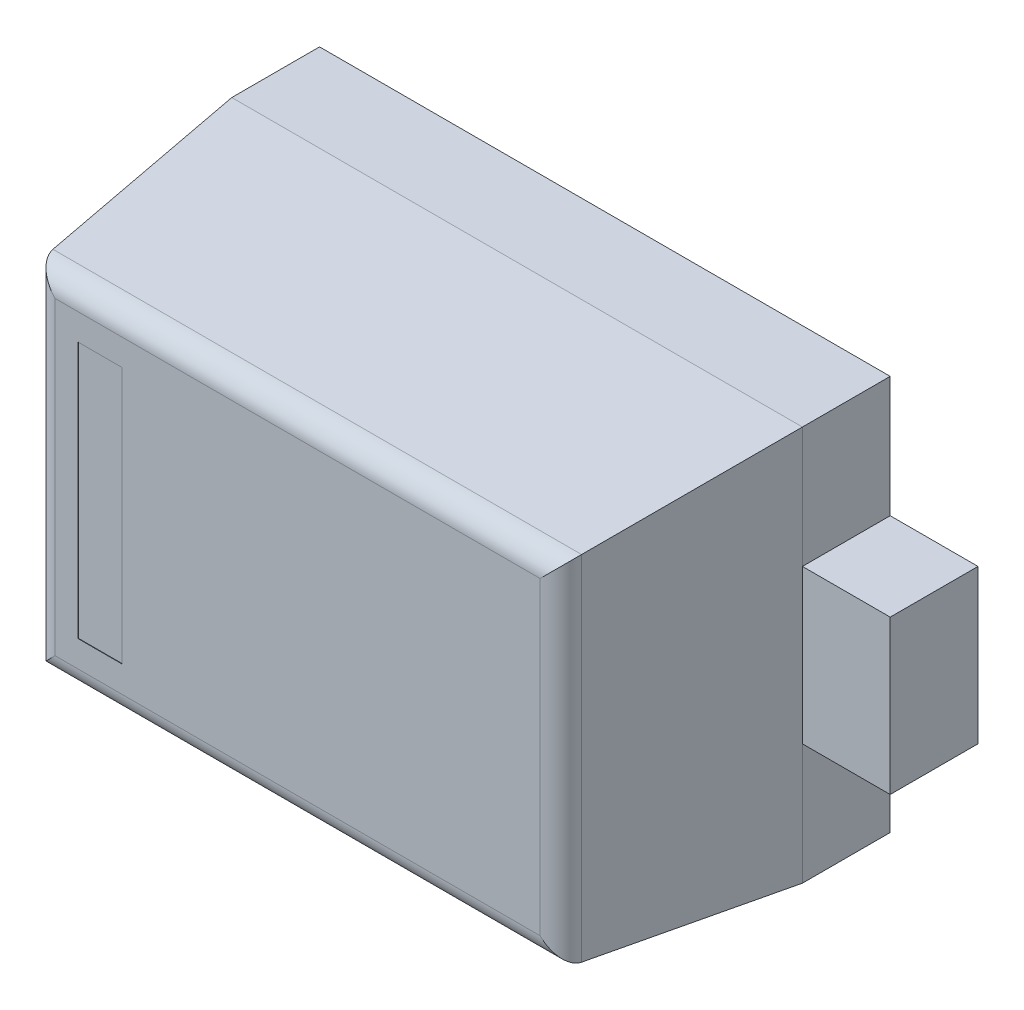
ISO-10303-21;
HEADER;
FILE_DESCRIPTION(('STEP AP214'),'2;1');
FILE_NAME('part.step','',(''),(''),'','','');
FILE_SCHEMA(('AUTOMOTIVE_DESIGN { 1 0 10303 214 1 1 1 1 }'));
ENDSEC;
DATA;
#1=APPLICATION_CONTEXT('core data for automotive mechanical design processes');
#2=APPLICATION_PROTOCOL_DEFINITION('international standard','automotive_design',2000,#1);
#3=PRODUCT_CONTEXT('',#1,'mechanical');
#4=PRODUCT('Part','Part','',(#3));
#5=PRODUCT_RELATED_PRODUCT_CATEGORY('part','',(#4));
#6=PRODUCT_DEFINITION_FORMATION('','',#4);
#7=PRODUCT_DEFINITION_CONTEXT('part definition',#1,'design');
#8=PRODUCT_DEFINITION('design','',#6,#7);
#9=PRODUCT_DEFINITION_SHAPE('','',#8);
#10=(LENGTH_UNIT() NAMED_UNIT(*) SI_UNIT(.MILLI.,.METRE.));
#11=(NAMED_UNIT(*) PLANE_ANGLE_UNIT() SI_UNIT($,.RADIAN.));
#12=(NAMED_UNIT(*) SI_UNIT($,.STERADIAN.) SOLID_ANGLE_UNIT());
#13=UNCERTAINTY_MEASURE_WITH_UNIT(LENGTH_MEASURE(1.E-05),#10,'distance_accuracy_value','');
#14=(GEOMETRIC_REPRESENTATION_CONTEXT(3) GLOBAL_UNCERTAINTY_ASSIGNED_CONTEXT((#13)) GLOBAL_UNIT_ASSIGNED_CONTEXT((#10,
#11,#12)) REPRESENTATION_CONTEXT('',''));
#15=CARTESIAN_POINT('',(0.,0.,0.));
#16=DIRECTION('',(0.,0.,1.));
#17=DIRECTION('',(1.,0.,0.));
#18=AXIS2_PLACEMENT_3D('',#15,#16,#17);
#19=CARTESIAN_POINT('',(0.,0.,0.2));
#20=DIRECTION('',(0.,0.,-1.));
#21=DIRECTION('',(0.,-1.,0.));
#22=AXIS2_PLACEMENT_3D('',#19,#20,#21);
#23=PLANE('',#22);
#24=DIRECTION('',(0.,-1.,0.));
#25=VECTOR('',#24,1.);
#26=CARTESIAN_POINT('',(-0.85,0.175,0.2));
#27=LINE('',#26,#25);
#28=CARTESIAN_POINT('',(-0.85,0.175,0.2));
#29=VERTEX_POINT('',#28);
#30=CARTESIAN_POINT('',(-0.85,-0.175,0.2));
#31=VERTEX_POINT('',#30);
#32=EDGE_CURVE('E262',#29,#31,#27,.T.);
#33=ORIENTED_EDGE('',*,*,#32,.T.);
#34=DIRECTION('',(1.,0.,0.));
#35=VECTOR('',#34,1.);
#36=CARTESIAN_POINT('',(-0.65,-0.175,0.2));
#37=LINE('',#36,#35);
#38=CARTESIAN_POINT('',(-0.65,-0.175,0.2));
#39=VERTEX_POINT('',#38);
#40=EDGE_CURVE('E30',#31,#39,#37,.T.);
#41=ORIENTED_EDGE('',*,*,#40,.T.);
#42=DIRECTION('',(0.,1.,0.));
#43=VECTOR('',#42,1.);
#44=CARTESIAN_POINT('',(-0.65,0.175,0.2));
#45=LINE('',#44,#43);
#46=CARTESIAN_POINT('',(-0.65,0.175,0.2));
#47=VERTEX_POINT('',#46);
#48=EDGE_CURVE('E276',#39,#47,#45,.T.);
#49=ORIENTED_EDGE('',*,*,#48,.T.);
#50=DIRECTION('',(-1.,0.,0.));
#51=VECTOR('',#50,1.);
#52=CARTESIAN_POINT('',(-0.65,0.175,0.2));
#53=LINE('',#52,#51);
#54=EDGE_CURVE('E11',#47,#29,#53,.T.);
#55=ORIENTED_EDGE('',*,*,#54,.T.);
#56=EDGE_LOOP('',(#33,#41,#49,#55));
#57=FACE_BOUND('',#56,.T.);
#58=ADVANCED_FACE('F18',(#57),#23,.F.);
#59=CARTESIAN_POINT('',(-0.65,0.175,0.2));
#60=DIRECTION('',(0.,-1.,0.));
#61=DIRECTION('',(0.,0.,-1.));
#62=AXIS2_PLACEMENT_3D('',#59,#60,#61);
#63=PLANE('',#62);
#64=DIRECTION('',(-1.,0.,0.));
#65=VECTOR('',#64,1.);
#66=CARTESIAN_POINT('',(-0.65,0.175,0.));
#67=LINE('',#66,#65);
#68=CARTESIAN_POINT('',(-0.65,0.175,0.));
#69=VERTEX_POINT('',#68);
#70=CARTESIAN_POINT('',(-0.85,0.175,0.));
#71=VERTEX_POINT('',#70);
#72=EDGE_CURVE('E237',#69,#71,#67,.T.);
#73=ORIENTED_EDGE('',*,*,#72,.T.);
#74=DIRECTION('',(0.,0.,-1.));
#75=VECTOR('',#74,1.);
#76=CARTESIAN_POINT('',(-0.85,0.175,0.2));
#77=LINE('',#76,#75);
#78=EDGE_CURVE('E265',#29,#71,#77,.T.);
#79=ORIENTED_EDGE('',*,*,#78,.F.);
#80=ORIENTED_EDGE('',*,*,#54,.F.);
#81=DIRECTION('',(0.,0.,-1.));
#82=VECTOR('',#81,1.);
#83=CARTESIAN_POINT('',(-0.65,0.175,0.2));
#84=LINE('',#83,#82);
#85=EDGE_CURVE('E331',#47,#69,#84,.T.);
#86=ORIENTED_EDGE('',*,*,#85,.T.);
#87=EDGE_LOOP('',(#73,#79,#80,#86));
#88=FACE_BOUND('',#87,.T.);
#89=ADVANCED_FACE('F448',(#88),#63,.F.);
#90=CARTESIAN_POINT('',(-0.65,-0.175,0.2));
#91=DIRECTION('',(0.,1.,0.));
#92=DIRECTION('',(1.,0.,0.));
#93=AXIS2_PLACEMENT_3D('',#90,#91,#92);
#94=PLANE('',#93);
#95=DIRECTION('',(1.,0.,0.));
#96=VECTOR('',#95,1.);
#97=CARTESIAN_POINT('',(-0.65,-0.175,0.));
#98=LINE('',#97,#96);
#99=CARTESIAN_POINT('',(-0.85,-0.175,0.));
#100=VERTEX_POINT('',#99);
#101=CARTESIAN_POINT('',(-0.65,-0.175,0.));
#102=VERTEX_POINT('',#101);
#103=EDGE_CURVE('E220',#100,#102,#98,.T.);
#104=ORIENTED_EDGE('',*,*,#103,.T.);
#105=DIRECTION('',(0.,0.,-1.));
#106=VECTOR('',#105,1.);
#107=CARTESIAN_POINT('',(-0.65,-0.175,0.2));
#108=LINE('',#107,#106);
#109=EDGE_CURVE('E256',#39,#102,#108,.T.);
#110=ORIENTED_EDGE('',*,*,#109,.F.);
#111=ORIENTED_EDGE('',*,*,#40,.F.);
#112=DIRECTION('',(0.,0.,-1.));
#113=VECTOR('',#112,1.);
#114=CARTESIAN_POINT('',(-0.85,-0.175,0.2));
#115=LINE('',#114,#113);
#116=EDGE_CURVE('E266',#31,#100,#115,.T.);
#117=ORIENTED_EDGE('',*,*,#116,.T.);
#118=EDGE_LOOP('',(#104,#110,#111,#117));
#119=FACE_BOUND('',#118,.T.);
#120=ADVANCED_FACE('F452',(#119),#94,.F.);
#121=CARTESIAN_POINT('',(-0.85,0.175,0.2));
#122=DIRECTION('',(1.,0.,0.));
#123=DIRECTION('',(0.,1.,0.));
#124=AXIS2_PLACEMENT_3D('',#121,#122,#123);
#125=PLANE('',#124);
#126=DIRECTION('',(0.,-1.,0.));
#127=VECTOR('',#126,1.);
#128=CARTESIAN_POINT('',(-0.85,0.175,0.));
#129=LINE('',#128,#127);
#130=EDGE_CURVE('E241',#71,#100,#129,.T.);
#131=ORIENTED_EDGE('',*,*,#130,.T.);
#132=ORIENTED_EDGE('',*,*,#116,.F.);
#133=ORIENTED_EDGE('',*,*,#32,.F.);
#134=ORIENTED_EDGE('',*,*,#78,.T.);
#135=EDGE_LOOP('',(#131,#132,#133,#134));
#136=FACE_BOUND('',#135,.T.);
#137=ADVANCED_FACE('F460',(#136),#125,.F.);
#138=CARTESIAN_POINT('',(0.,0.,0.2));
#139=DIRECTION('',(0.,0.,-1.));
#140=DIRECTION('',(0.,-1.,0.));
#141=AXIS2_PLACEMENT_3D('',#138,#139,#140);
#142=PLANE('',#141);
#143=DIRECTION('',(0.,1.,0.));
#144=VECTOR('',#143,1.);
#145=CARTESIAN_POINT('',(0.85,-0.175,0.2));
#146=LINE('',#145,#144);
#147=CARTESIAN_POINT('',(0.85,-0.175,0.2));
#148=VERTEX_POINT('',#147);
#149=CARTESIAN_POINT('',(0.85,0.175,0.2));
#150=VERTEX_POINT('',#149);
#151=EDGE_CURVE('E322',#148,#150,#146,.T.);
#152=ORIENTED_EDGE('',*,*,#151,.T.);
#153=DIRECTION('',(-1.,0.,0.));
#154=VECTOR('',#153,1.);
#155=CARTESIAN_POINT('',(0.65,0.175,0.2));
#156=LINE('',#155,#154);
#157=CARTESIAN_POINT('',(0.65,0.175,0.2));
#158=VERTEX_POINT('',#157);
#159=EDGE_CURVE('E150',#150,#158,#156,.T.);
#160=ORIENTED_EDGE('',*,*,#159,.T.);
#161=DIRECTION('',(0.,-1.,0.));
#162=VECTOR('',#161,1.);
#163=CARTESIAN_POINT('',(0.65,-0.175,0.2));
#164=LINE('',#163,#162);
#165=CARTESIAN_POINT('',(0.65,-0.175,0.2));
#166=VERTEX_POINT('',#165);
#167=EDGE_CURVE('E316',#158,#166,#164,.T.);
#168=ORIENTED_EDGE('',*,*,#167,.T.);
#169=DIRECTION('',(1.,0.,0.));
#170=VECTOR('',#169,1.);
#171=CARTESIAN_POINT('',(0.65,-0.175,0.2));
#172=LINE('',#171,#170);
#173=EDGE_CURVE('E359',#166,#148,#172,.T.);
#174=ORIENTED_EDGE('',*,*,#173,.T.);
#175=EDGE_LOOP('',(#152,#160,#168,#174));
#176=FACE_BOUND('',#175,.T.);
#177=ADVANCED_FACE('F442',(#176),#142,.F.);
#178=CARTESIAN_POINT('',(0.65,-0.175,0.2));
#179=DIRECTION('',(0.,1.,0.));
#180=DIRECTION('',(1.,0.,0.));
#181=AXIS2_PLACEMENT_3D('',#178,#179,#180);
#182=PLANE('',#181);
#183=DIRECTION('',(1.,0.,0.));
#184=VECTOR('',#183,1.);
#185=CARTESIAN_POINT('',(0.65,-0.175,0.));
#186=LINE('',#185,#184);
#187=CARTESIAN_POINT('',(0.65,-0.175,0.));
#188=VERTEX_POINT('',#187);
#189=CARTESIAN_POINT('',(0.85,-0.175,0.));
#190=VERTEX_POINT('',#189);
#191=EDGE_CURVE('E261',#188,#190,#186,.T.);
#192=ORIENTED_EDGE('',*,*,#191,.T.);
#193=DIRECTION('',(0.,0.,-1.));
#194=VECTOR('',#193,1.);
#195=CARTESIAN_POINT('',(0.85,-0.175,0.2));
#196=LINE('',#195,#194);
#197=EDGE_CURVE('E360',#148,#190,#196,.T.);
#198=ORIENTED_EDGE('',*,*,#197,.F.);
#199=ORIENTED_EDGE('',*,*,#173,.F.);
#200=DIRECTION('',(0.,0.,-1.));
#201=VECTOR('',#200,1.);
#202=CARTESIAN_POINT('',(0.65,-0.175,0.2));
#203=LINE('',#202,#201);
#204=EDGE_CURVE('E293',#166,#188,#203,.T.);
#205=ORIENTED_EDGE('',*,*,#204,.T.);
#206=EDGE_LOOP('',(#192,#198,#199,#205));
#207=FACE_BOUND('',#206,.T.);
#208=ADVANCED_FACE('F433',(#207),#182,.F.);
#209=CARTESIAN_POINT('',(0.65,0.175,0.2));
#210=DIRECTION('',(0.,-1.,0.));
#211=DIRECTION('',(-1.,0.,0.));
#212=AXIS2_PLACEMENT_3D('',#209,#210,#211);
#213=PLANE('',#212);
#214=DIRECTION('',(-1.,0.,0.));
#215=VECTOR('',#214,1.);
#216=CARTESIAN_POINT('',(0.65,0.175,0.));
#217=LINE('',#216,#215);
#218=CARTESIAN_POINT('',(0.85,0.175,0.));
#219=VERTEX_POINT('',#218);
#220=CARTESIAN_POINT('',(0.65,0.175,0.));
#221=VERTEX_POINT('',#220);
#222=EDGE_CURVE('E172',#219,#221,#217,.T.);
#223=ORIENTED_EDGE('',*,*,#222,.T.);
#224=DIRECTION('',(0.,0.,-1.));
#225=VECTOR('',#224,1.);
#226=CARTESIAN_POINT('',(0.65,0.175,0.2));
#227=LINE('',#226,#225);
#228=EDGE_CURVE('E315',#158,#221,#227,.T.);
#229=ORIENTED_EDGE('',*,*,#228,.F.);
#230=ORIENTED_EDGE('',*,*,#159,.F.);
#231=DIRECTION('',(0.,0.,-1.));
#232=VECTOR('',#231,1.);
#233=CARTESIAN_POINT('',(0.85,0.175,0.2));
#234=LINE('',#233,#232);
#235=EDGE_CURVE('E305',#150,#219,#234,.T.);
#236=ORIENTED_EDGE('',*,*,#235,.T.);
#237=EDGE_LOOP('',(#223,#229,#230,#236));
#238=FACE_BOUND('',#237,.T.);
#239=ADVANCED_FACE('F430',(#238),#213,.F.);
#240=CARTESIAN_POINT('',(0.85,-0.175,0.2));
#241=DIRECTION('',(-1.,0.,0.));
#242=DIRECTION('',(0.,0.,1.));
#243=AXIS2_PLACEMENT_3D('',#240,#241,#242);
#244=PLANE('',#243);
#245=DIRECTION('',(0.,1.,0.));
#246=VECTOR('',#245,1.);
#247=CARTESIAN_POINT('',(0.85,-0.175,0.));
#248=LINE('',#247,#246);
#249=EDGE_CURVE('E257',#190,#219,#248,.T.);
#250=ORIENTED_EDGE('',*,*,#249,.T.);
#251=ORIENTED_EDGE('',*,*,#235,.F.);
#252=ORIENTED_EDGE('',*,*,#151,.F.);
#253=ORIENTED_EDGE('',*,*,#197,.T.);
#254=EDGE_LOOP('',(#250,#251,#252,#253));
#255=FACE_BOUND('',#254,.T.);
#256=ADVANCED_FACE('F432',(#255),#244,.F.);
#257=CARTESIAN_POINT('',(0.,0.,0.699));
#258=DIRECTION('',(0.,0.,1.));
#259=DIRECTION('',(1.,0.,0.));
#260=AXIS2_PLACEMENT_3D('',#257,#258,#259);
#261=PLANE('',#260);
#262=DIRECTION('',(0.,1.,0.));
#263=VECTOR('',#262,1.);
#264=CARTESIAN_POINT('',(-0.4,0.2925,0.699));
#265=LINE('',#264,#263);
#266=CARTESIAN_POINT('',(-0.4,-0.2925,0.699));
#267=VERTEX_POINT('',#266);
#268=CARTESIAN_POINT('',(-0.4,0.2925,0.699));
#269=VERTEX_POINT('',#268);
#270=EDGE_CURVE('E274',#267,#269,#265,.T.);
#271=ORIENTED_EDGE('',*,*,#270,.T.);
#272=DIRECTION('',(-1.,0.,0.));
#273=VECTOR('',#272,1.);
#274=CARTESIAN_POINT('',(-0.5,0.2925,0.699));
#275=LINE('',#274,#273);
#276=CARTESIAN_POINT('',(-0.5,0.2925,0.699));
#277=VERTEX_POINT('',#276);
#278=EDGE_CURVE('E163',#269,#277,#275,.T.);
#279=ORIENTED_EDGE('',*,*,#278,.T.);
#280=DIRECTION('',(0.,-1.,0.));
#281=VECTOR('',#280,1.);
#282=CARTESIAN_POINT('',(-0.5,0.2925,0.699));
#283=LINE('',#282,#281);
#284=CARTESIAN_POINT('',(-0.5,-0.2925,0.699));
#285=VERTEX_POINT('',#284);
#286=EDGE_CURVE('E207',#277,#285,#283,.T.);
#287=ORIENTED_EDGE('',*,*,#286,.T.);
#288=DIRECTION('',(1.,0.,0.));
#289=VECTOR('',#288,1.);
#290=CARTESIAN_POINT('',(-0.5,-0.2925,0.699));
#291=LINE('',#290,#289);
#292=EDGE_CURVE('E335',#285,#267,#291,.T.);
#293=ORIENTED_EDGE('',*,*,#292,.T.);
#294=EDGE_LOOP('',(#271,#279,#287,#293));
#295=FACE_BOUND('',#294,.T.);
#296=ADVANCED_FACE('F403',(#295),#261,.T.);
#297=CARTESIAN_POINT('',(-0.5,0.2925,0.699));
#298=DIRECTION('',(0.,1.,0.));
#299=DIRECTION('',(1.,0.,0.));
#300=AXIS2_PLACEMENT_3D('',#297,#298,#299);
#301=PLANE('',#300);
#302=DIRECTION('',(-1.,0.,0.));
#303=VECTOR('',#302,1.);
#304=CARTESIAN_POINT('',(-0.5,0.2925,0.7));
#305=LINE('',#304,#303);
#306=CARTESIAN_POINT('',(-0.4,0.2925,0.7));
#307=VERTEX_POINT('',#306);
#308=CARTESIAN_POINT('',(-0.5,0.2925,0.7));
#309=VERTEX_POINT('',#308);
#310=EDGE_CURVE('E212',#307,#309,#305,.T.);
#311=ORIENTED_EDGE('',*,*,#310,.T.);
#312=DIRECTION('',(0.,0.,1.));
#313=VECTOR('',#312,1.);
#314=CARTESIAN_POINT('',(-0.5,0.2925,0.699));
#315=LINE('',#314,#313);
#316=EDGE_CURVE('E200',#277,#309,#315,.T.);
#317=ORIENTED_EDGE('',*,*,#316,.F.);
#318=ORIENTED_EDGE('',*,*,#278,.F.);
#319=DIRECTION('',(0.,0.,1.));
#320=VECTOR('',#319,1.);
#321=CARTESIAN_POINT('',(-0.4,0.2925,0.699));
#322=LINE('',#321,#320);
#323=EDGE_CURVE('E215',#269,#307,#322,.T.);
#324=ORIENTED_EDGE('',*,*,#323,.T.);
#325=EDGE_LOOP('',(#311,#317,#318,#324));
#326=FACE_BOUND('',#325,.T.);
#327=ADVANCED_FACE('F213',(#326),#301,.F.);
#328=CARTESIAN_POINT('',(-0.5,0.2925,0.699));
#329=DIRECTION('',(-1.,0.,0.));
#330=DIRECTION('',(0.,1.,0.));
#331=AXIS2_PLACEMENT_3D('',#328,#329,#330);
#332=PLANE('',#331);
#333=DIRECTION('',(0.,-1.,0.));
#334=VECTOR('',#333,1.);
#335=CARTESIAN_POINT('',(-0.5,0.2925,0.7));
#336=LINE('',#335,#334);
#337=CARTESIAN_POINT('',(-0.5,-0.2925,0.7));
#338=VERTEX_POINT('',#337);
#339=EDGE_CURVE('E205',#309,#338,#336,.T.);
#340=ORIENTED_EDGE('',*,*,#339,.T.);
#341=DIRECTION('',(0.,0.,1.));
#342=VECTOR('',#341,1.);
#343=CARTESIAN_POINT('',(-0.5,-0.2925,0.699));
#344=LINE('',#343,#342);
#345=EDGE_CURVE('E302',#285,#338,#344,.T.);
#346=ORIENTED_EDGE('',*,*,#345,.F.);
#347=ORIENTED_EDGE('',*,*,#286,.F.);
#348=ORIENTED_EDGE('',*,*,#316,.T.);
#349=EDGE_LOOP('',(#340,#346,#347,#348));
#350=FACE_BOUND('',#349,.T.);
#351=ADVANCED_FACE('F202',(#350),#332,.F.);
#352=CARTESIAN_POINT('',(-0.5,-0.2925,0.699));
#353=DIRECTION('',(0.,-1.,0.));
#354=DIRECTION('',(-1.,0.,0.));
#355=AXIS2_PLACEMENT_3D('',#352,#353,#354);
#356=PLANE('',#355);
#357=DIRECTION('',(1.,0.,0.));
#358=VECTOR('',#357,1.);
#359=CARTESIAN_POINT('',(-0.5,-0.2925,0.7));
#360=LINE('',#359,#358);
#361=CARTESIAN_POINT('',(-0.4,-0.2925,0.7));
#362=VERTEX_POINT('',#361);
#363=EDGE_CURVE('E225',#338,#362,#360,.T.);
#364=ORIENTED_EDGE('',*,*,#363,.T.);
#365=DIRECTION('',(0.,0.,1.));
#366=VECTOR('',#365,1.);
#367=CARTESIAN_POINT('',(-0.4,-0.2925,0.699));
#368=LINE('',#367,#366);
#369=EDGE_CURVE('E338',#267,#362,#368,.T.);
#370=ORIENTED_EDGE('',*,*,#369,.F.);
#371=ORIENTED_EDGE('',*,*,#292,.F.);
#372=ORIENTED_EDGE('',*,*,#345,.T.);
#373=EDGE_LOOP('',(#364,#370,#371,#372));
#374=FACE_BOUND('',#373,.T.);
#375=ADVANCED_FACE('F400',(#374),#356,.F.);
#376=CARTESIAN_POINT('',(-0.4,0.2925,0.699));
#377=DIRECTION('',(1.,0.,0.));
#378=DIRECTION('',(0.,1.,0.));
#379=AXIS2_PLACEMENT_3D('',#376,#377,#378);
#380=PLANE('',#379);
#381=DIRECTION('',(0.,1.,0.));
#382=VECTOR('',#381,1.);
#383=CARTESIAN_POINT('',(-0.4,0.2925,0.7));
#384=LINE('',#383,#382);
#385=EDGE_CURVE('E232',#362,#307,#384,.T.);
#386=ORIENTED_EDGE('',*,*,#385,.T.);
#387=ORIENTED_EDGE('',*,*,#323,.F.);
#388=ORIENTED_EDGE('',*,*,#270,.F.);
#389=ORIENTED_EDGE('',*,*,#369,.T.);
#390=EDGE_LOOP('',(#386,#387,#388,#389));
#391=FACE_BOUND('',#390,.T.);
#392=ADVANCED_FACE('F407',(#391),#380,.F.);
#393=CARTESIAN_POINT('',(0.,0.352427680152268,0.65));
#394=DIRECTION('',(-1.,0.,0.));
#395=DIRECTION('',(0.,-1.,0.));
#396=AXIS2_PLACEMENT_3D('',#393,#394,#395);
#397=CYLINDRICAL_SURFACE('',#396,0.05);
#398=CARTESIAN_POINT('',(0.55242768015227,0.352427680152268,0.7));
#399=CARTESIAN_POINT('',(0.579340498057533,0.379340498057531,0.7));
#400=CARTESIAN_POINT('',(0.599340619422844,0.399340619422842,0.681991809836226));
#401=CARTESIAN_POINT('',(0.602153774920683,0.402153774920681,0.655226423163382));
#402=(BOUNDED_CURVE() B_SPLINE_CURVE(3,(#398,#399,#400,#401),.UNSPECIFIED.,.F.,
.F.) B_SPLINE_CURVE_WITH_KNOTS((4,4),(4.71238898038469,6.17846555205993),
.UNSPECIFIED.) CURVE() GEOMETRIC_REPRESENTATION_ITEM() RATIONAL_B_SPLINE_CURVE((1.,
0.828763216984929,0.828763216984929,1.)) REPRESENTATION_ITEM(''));
#403=CARTESIAN_POINT('',(0.55242768015227,0.352427680152268,0.7));
#404=VERTEX_POINT('',#403);
#405=CARTESIAN_POINT('',(0.602153774920683,0.402153774920681,0.655226423163382));
#406=VERTEX_POINT('',#405);
#407=EDGE_CURVE('E21',#404,#406,#402,.T.);
#408=ORIENTED_EDGE('',*,*,#407,.T.);
#409=DIRECTION('',(1.,0.,0.));
#410=VECTOR('',#409,1.);
#411=CARTESIAN_POINT('',(0.,0.402153774920682,0.655226423163382));
#412=LINE('',#411,#410);
#413=CARTESIAN_POINT('',(-0.602153774920683,0.402153774920682,0.655226423163382));
#414=VERTEX_POINT('',#413);
#415=EDGE_CURVE('E271',#414,#406,#412,.T.);
#416=ORIENTED_EDGE('',*,*,#415,.F.);
#417=CARTESIAN_POINT('',(-0.602153774920683,0.402153774920682,0.655226423163382));
#418=CARTESIAN_POINT('',(-0.599340619422844,0.399340619422843,0.681991809836226));
#419=CARTESIAN_POINT('',(-0.579340498057532,0.379340498057531,0.7));
#420=CARTESIAN_POINT('',(-0.552427680152269,0.352427680152268,0.7));
#421=(BOUNDED_CURVE() B_SPLINE_CURVE(3,(#417,#418,#419,#420),.UNSPECIFIED.,.F.,
.F.) B_SPLINE_CURVE_WITH_KNOTS((4,4),(3.24631240870945,4.71238898038469),
.UNSPECIFIED.) CURVE() GEOMETRIC_REPRESENTATION_ITEM() RATIONAL_B_SPLINE_CURVE((1.,
0.828763216984929,0.828763216984929,1.)) REPRESENTATION_ITEM(''));
#422=CARTESIAN_POINT('',(-0.552427680152269,0.352427680152268,0.7));
#423=VERTEX_POINT('',#422);
#424=EDGE_CURVE('E275',#414,#423,#421,.T.);
#425=ORIENTED_EDGE('',*,*,#424,.T.);
#426=DIRECTION('',(-1.,0.,0.));
#427=VECTOR('',#426,1.);
#428=CARTESIAN_POINT('',(0.,0.352427680152268,0.7));
#429=LINE('',#428,#427);
#430=EDGE_CURVE('E391',#404,#423,#429,.T.);
#431=ORIENTED_EDGE('',*,*,#430,.F.);
#432=EDGE_LOOP('',(#408,#416,#425,#431));
#433=FACE_BOUND('',#432,.T.);
#434=ADVANCED_FACE('F515',(#433),#397,.T.);
#435=CARTESIAN_POINT('',(-0.552427680152269,0.,0.65));
#436=DIRECTION('',(0.,-1.,0.));
#437=DIRECTION('',(0.,0.,-1.));
#438=AXIS2_PLACEMENT_3D('',#435,#436,#437);
#439=CYLINDRICAL_SURFACE('',#438,0.05);
#440=CARTESIAN_POINT('',(-0.602153774920683,-0.402153774920684,0.655226423163383));
#441=CARTESIAN_POINT('',(-0.599340619422842,-0.399340619422845,0.681991809836226));
#442=CARTESIAN_POINT('',(-0.579340498057532,-0.379340498057534,0.7));
#443=CARTESIAN_POINT('',(-0.552427680152269,-0.352427680152271,0.7));
#444=(BOUNDED_CURVE() B_SPLINE_CURVE(3,(#440,#441,#442,#443),.UNSPECIFIED.,.F.,
.F.) B_SPLINE_CURVE_WITH_KNOTS((4,4),(0.104719755119658,1.5707963267949),
.UNSPECIFIED.) CURVE() GEOMETRIC_REPRESENTATION_ITEM() RATIONAL_B_SPLINE_CURVE((1.,
0.828763216984929,0.828763216984929,1.)) REPRESENTATION_ITEM(''));
#445=CARTESIAN_POINT('',(-0.602153774920683,-0.402153774920684,0.655226423163383));
#446=VERTEX_POINT('',#445);
#447=CARTESIAN_POINT('',(-0.552427680152269,-0.352427680152271,0.7));
#448=VERTEX_POINT('',#447);
#449=EDGE_CURVE('E247',#446,#448,#444,.T.);
#450=ORIENTED_EDGE('',*,*,#449,.T.);
#451=DIRECTION('',(0.,-1.,0.));
#452=VECTOR('',#451,1.);
#453=CARTESIAN_POINT('',(-0.552427680152269,0.,0.7));
#454=LINE('',#453,#452);
#455=EDGE_CURVE('E387',#423,#448,#454,.T.);
#456=ORIENTED_EDGE('',*,*,#455,.F.);
#457=ORIENTED_EDGE('',*,*,#424,.F.);
#458=DIRECTION('',(0.,1.,0.));
#459=VECTOR('',#458,1.);
#460=CARTESIAN_POINT('',(-0.602153774920683,0.,0.655226423163382));
#461=LINE('',#460,#459);
#462=EDGE_CURVE('E280',#446,#414,#461,.T.);
#463=ORIENTED_EDGE('',*,*,#462,.F.);
#464=EDGE_LOOP('',(#450,#456,#457,#463));
#465=FACE_BOUND('',#464,.T.);
#466=ADVANCED_FACE('F523',(#465),#439,.T.);
#467=CARTESIAN_POINT('',(0.55242768015227,0.,0.65));
#468=DIRECTION('',(0.,1.,0.));
#469=DIRECTION('',(-1.,0.,0.));
#470=AXIS2_PLACEMENT_3D('',#467,#468,#469);
#471=CYLINDRICAL_SURFACE('',#470,0.05);
#472=CARTESIAN_POINT('',(0.55242768015227,-0.352427680152271,0.7));
#473=CARTESIAN_POINT('',(0.579340498057533,-0.379340498057534,0.7));
#474=CARTESIAN_POINT('',(0.599340619422844,-0.399340619422845,0.681991809836226));
#475=CARTESIAN_POINT('',(0.602153774920684,-0.402153774920684,0.655226423163383));
#476=(BOUNDED_CURVE() B_SPLINE_CURVE(3,(#472,#473,#474,#475),.UNSPECIFIED.,.F.,
.F.) B_SPLINE_CURVE_WITH_KNOTS((4,4),(4.71238898038469,6.17846555205993),
.UNSPECIFIED.) CURVE() GEOMETRIC_REPRESENTATION_ITEM() RATIONAL_B_SPLINE_CURVE((1.,
0.828763216984929,0.828763216984929,1.)) REPRESENTATION_ITEM(''));
#477=CARTESIAN_POINT('',(0.55242768015227,-0.352427680152271,0.7));
#478=VERTEX_POINT('',#477);
#479=CARTESIAN_POINT('',(0.602153774920684,-0.402153774920684,0.655226423163383));
#480=VERTEX_POINT('',#479);
#481=EDGE_CURVE('E242',#478,#480,#476,.T.);
#482=ORIENTED_EDGE('',*,*,#481,.T.);
#483=DIRECTION('',(0.,-1.,0.));
#484=VECTOR('',#483,1.);
#485=CARTESIAN_POINT('',(0.602153774920683,0.,0.655226423163382));
#486=LINE('',#485,#484);
#487=EDGE_CURVE('E279',#406,#480,#486,.T.);
#488=ORIENTED_EDGE('',*,*,#487,.F.);
#489=ORIENTED_EDGE('',*,*,#407,.F.);
#490=DIRECTION('',(0.,1.,0.));
#491=VECTOR('',#490,1.);
#492=CARTESIAN_POINT('',(0.55242768015227,0.,0.7));
#493=LINE('',#492,#491);
#494=EDGE_CURVE('E502',#478,#404,#493,.T.);
#495=ORIENTED_EDGE('',*,*,#494,.F.);
#496=EDGE_LOOP('',(#482,#488,#489,#495));
#497=FACE_BOUND('',#496,.T.);
#498=ADVANCED_FACE('F529',(#497),#471,.T.);
#499=CARTESIAN_POINT('',(0.,-0.352427680152271,0.65));
#500=DIRECTION('',(1.,0.,0.));
#501=DIRECTION('',(0.,0.,-1.));
#502=AXIS2_PLACEMENT_3D('',#499,#500,#501);
#503=CYLINDRICAL_SURFACE('',#502,0.05);
#504=ORIENTED_EDGE('',*,*,#449,.F.);
#505=DIRECTION('',(-1.,0.,0.));
#506=VECTOR('',#505,1.);
#507=CARTESIAN_POINT('',(0.,-0.402153774920684,0.655226423163382));
#508=LINE('',#507,#506);
#509=EDGE_CURVE('E285',#480,#446,#508,.T.);
#510=ORIENTED_EDGE('',*,*,#509,.F.);
#511=ORIENTED_EDGE('',*,*,#481,.F.);
#512=DIRECTION('',(1.,0.,0.));
#513=VECTOR('',#512,1.);
#514=CARTESIAN_POINT('',(0.,-0.352427680152271,0.7));
#515=LINE('',#514,#513);
#516=EDGE_CURVE('E390',#448,#478,#515,.T.);
#517=ORIENTED_EDGE('',*,*,#516,.F.);
#518=EDGE_LOOP('',(#504,#510,#511,#517));
#519=FACE_BOUND('',#518,.T.);
#520=ADVANCED_FACE('F527',(#519),#503,.T.);
#521=CARTESIAN_POINT('',(0.,-0.397447882367163,0.7));
#522=DIRECTION('',(0.,-0.994521895368274,0.10452846326765));
#523=DIRECTION('',(-1.,0.,0.));
#524=AXIS2_PLACEMENT_3D('',#521,#522,#523);
#525=PLANE('',#524);
#526=DIRECTION('',(-0.103962051184495,0.103962051184495,0.989132844377854));
#527=VECTOR('',#526,1.);
#528=CARTESIAN_POINT('',(0.593152222695792,-0.393152222695793,0.74087047168472));
#529=LINE('',#528,#527);
#530=CARTESIAN_POINT('',(0.65,-0.45,0.199999999999984));
#531=VERTEX_POINT('',#530);
#532=EDGE_CURVE('E319',#531,#480,#529,.T.);
#533=ORIENTED_EDGE('',*,*,#532,.T.);
#534=ORIENTED_EDGE('',*,*,#509,.T.);
#535=DIRECTION('',(-0.103962051184495,-0.103962051184495,-0.989132844377854));
#536=VECTOR('',#535,1.);
#537=CARTESIAN_POINT('',(-0.593152222695791,-0.393152222695793,0.74087047168472));
#538=LINE('',#537,#536);
#539=CARTESIAN_POINT('',(-0.65,-0.45,0.199999999999984));
#540=VERTEX_POINT('',#539);
#541=EDGE_CURVE('E295',#446,#540,#538,.T.);
#542=ORIENTED_EDGE('',*,*,#541,.T.);
#543=DIRECTION('',(-1.,0.,0.));
#544=VECTOR('',#543,1.);
#545=CARTESIAN_POINT('',(-0.65,-0.45,0.199999999999983));
#546=LINE('',#545,#544);
#547=EDGE_CURVE('E351',#531,#540,#546,.T.);
#548=ORIENTED_EDGE('',*,*,#547,.F.);
#549=EDGE_LOOP('',(#533,#534,#542,#548));
#550=FACE_BOUND('',#549,.T.);
#551=ADVANCED_FACE('F544',(#550),#525,.T.);
#552=CARTESIAN_POINT('',(0.597447882367162,0.,0.7));
#553=DIRECTION('',(0.994521895368274,0.,0.10452846326765));
#554=DIRECTION('',(0.,-1.,0.));
#555=AXIS2_PLACEMENT_3D('',#552,#553,#554);
#556=PLANE('',#555);
#557=DIRECTION('',(-0.103962051184495,-0.103962051184495,0.989132844377854));
#558=VECTOR('',#557,1.);
#559=CARTESIAN_POINT('',(0.593152222695792,0.39315222269579,0.74087047168472));
#560=LINE('',#559,#558);
#561=CARTESIAN_POINT('',(0.65,0.45,0.199999999999984));
#562=VERTEX_POINT('',#561);
#563=EDGE_CURVE('E299',#562,#406,#560,.T.);
#564=ORIENTED_EDGE('',*,*,#563,.T.);
#565=ORIENTED_EDGE('',*,*,#487,.T.);
#566=ORIENTED_EDGE('',*,*,#532,.F.);
#567=DIRECTION('',(0.,-1.,0.));
#568=VECTOR('',#567,1.);
#569=CARTESIAN_POINT('',(0.65,-0.45,0.199999999999983));
#570=LINE('',#569,#568);
#571=EDGE_CURVE('E347',#166,#531,#570,.T.);
#572=ORIENTED_EDGE('',*,*,#571,.F.);
#573=ORIENTED_EDGE('',*,*,#167,.F.);
#574=DIRECTION('',(0.,-1.,0.));
#575=VECTOR('',#574,1.);
#576=CARTESIAN_POINT('',(0.65,-0.45,0.199999999999983));
#577=LINE('',#576,#575);
#578=EDGE_CURVE('E364',#562,#158,#577,.T.);
#579=ORIENTED_EDGE('',*,*,#578,.F.);
#580=EDGE_LOOP('',(#564,#565,#566,#572,#573,#579));
#581=FACE_BOUND('',#580,.T.);
#582=ADVANCED_FACE('F538',(#581),#556,.T.);
#583=CARTESIAN_POINT('',(-0.597447882367161,0.,0.7));
#584=DIRECTION('',(-0.994521895368274,0.,0.10452846326765));
#585=DIRECTION('',(0.,1.,0.));
#586=AXIS2_PLACEMENT_3D('',#583,#584,#585);
#587=PLANE('',#586);
#588=ORIENTED_EDGE('',*,*,#541,.F.);
#589=ORIENTED_EDGE('',*,*,#462,.T.);
#590=DIRECTION('',(-0.103962051184495,0.103962051184495,-0.989132844377854));
#591=VECTOR('',#590,1.);
#592=CARTESIAN_POINT('',(-0.590990601078494,0.390990601078493,0.761436927563815));
#593=LINE('',#592,#591);
#594=CARTESIAN_POINT('',(-0.65,0.45,0.199999999999984));
#595=VERTEX_POINT('',#594);
#596=EDGE_CURVE('E267',#414,#595,#593,.T.);
#597=ORIENTED_EDGE('',*,*,#596,.T.);
#598=DIRECTION('',(0.,1.,0.));
#599=VECTOR('',#598,1.);
#600=CARTESIAN_POINT('',(-0.65,0.45,0.199999999999983));
#601=LINE('',#600,#599);
#602=EDGE_CURVE('E309',#47,#595,#601,.T.);
#603=ORIENTED_EDGE('',*,*,#602,.F.);
#604=ORIENTED_EDGE('',*,*,#48,.F.);
#605=DIRECTION('',(0.,1.,0.));
#606=VECTOR('',#605,1.);
#607=CARTESIAN_POINT('',(-0.65,0.45,0.199999999999983));
#608=LINE('',#607,#606);
#609=EDGE_CURVE('E326',#540,#39,#608,.T.);
#610=ORIENTED_EDGE('',*,*,#609,.F.);
#611=EDGE_LOOP('',(#588,#589,#597,#603,#604,#610));
#612=FACE_BOUND('',#611,.T.);
#613=ADVANCED_FACE('F543',(#612),#587,.T.);
#614=CARTESIAN_POINT('',(0.,0.39744788236716,0.7));
#615=DIRECTION('',(0.,0.994521895368274,0.10452846326765));
#616=DIRECTION('',(1.,0.,0.));
#617=AXIS2_PLACEMENT_3D('',#614,#615,#616);
#618=PLANE('',#617);
#619=ORIENTED_EDGE('',*,*,#596,.F.);
#620=ORIENTED_EDGE('',*,*,#415,.T.);
#621=ORIENTED_EDGE('',*,*,#563,.F.);
#622=DIRECTION('',(1.,0.,0.));
#623=VECTOR('',#622,1.);
#624=CARTESIAN_POINT('',(0.65,0.45,0.199999999999983));
#625=LINE('',#624,#623);
#626=EDGE_CURVE('E327',#595,#562,#625,.T.);
#627=ORIENTED_EDGE('',*,*,#626,.F.);
#628=EDGE_LOOP('',(#619,#620,#621,#627));
#629=FACE_BOUND('',#628,.T.);
#630=ADVANCED_FACE('F576',(#629),#618,.T.);
#631=CARTESIAN_POINT('',(0.,0.,0.));
#632=DIRECTION('',(0.,0.,1.));
#633=DIRECTION('',(1.,0.,0.));
#634=AXIS2_PLACEMENT_3D('',#631,#632,#633);
#635=PLANE('',#634);
#636=DIRECTION('',(0.,1.,0.));
#637=VECTOR('',#636,1.);
#638=CARTESIAN_POINT('',(0.65,0.45,0.));
#639=LINE('',#638,#637);
#640=CARTESIAN_POINT('',(0.65,-0.45,0.));
#641=VERTEX_POINT('',#640);
#642=EDGE_CURVE('E346',#641,#188,#639,.T.);
#643=ORIENTED_EDGE('',*,*,#642,.F.);
#644=DIRECTION('',(1.,0.,0.));
#645=VECTOR('',#644,1.);
#646=CARTESIAN_POINT('',(-0.65,-0.45,0.));
#647=LINE('',#646,#645);
#648=CARTESIAN_POINT('',(-0.65,-0.45,0.));
#649=VERTEX_POINT('',#648);
#650=EDGE_CURVE('E505',#649,#641,#647,.T.);
#651=ORIENTED_EDGE('',*,*,#650,.F.);
#652=DIRECTION('',(0.,-1.,0.));
#653=VECTOR('',#652,1.);
#654=CARTESIAN_POINT('',(-0.65,0.45,0.));
#655=LINE('',#654,#653);
#656=EDGE_CURVE('E248',#102,#649,#655,.T.);
#657=ORIENTED_EDGE('',*,*,#656,.F.);
#658=ORIENTED_EDGE('',*,*,#103,.F.);
#659=ORIENTED_EDGE('',*,*,#130,.F.);
#660=ORIENTED_EDGE('',*,*,#72,.F.);
#661=DIRECTION('',(0.,-1.,0.));
#662=VECTOR('',#661,1.);
#663=CARTESIAN_POINT('',(-0.65,0.45,0.));
#664=LINE('',#663,#662);
#665=CARTESIAN_POINT('',(-0.65,0.45,0.));
#666=VERTEX_POINT('',#665);
#667=EDGE_CURVE('E286',#666,#69,#664,.T.);
#668=ORIENTED_EDGE('',*,*,#667,.F.);
#669=DIRECTION('',(-1.,0.,0.));
#670=VECTOR('',#669,1.);
#671=CARTESIAN_POINT('',(-0.65,0.45,0.));
#672=LINE('',#671,#670);
#673=CARTESIAN_POINT('',(0.65,0.45,0.));
#674=VERTEX_POINT('',#673);
#675=EDGE_CURVE('E323',#674,#666,#672,.T.);
#676=ORIENTED_EDGE('',*,*,#675,.F.);
#677=DIRECTION('',(0.,1.,0.));
#678=VECTOR('',#677,1.);
#679=CARTESIAN_POINT('',(0.65,0.45,0.));
#680=LINE('',#679,#678);
#681=EDGE_CURVE('E310',#221,#674,#680,.T.);
#682=ORIENTED_EDGE('',*,*,#681,.F.);
#683=ORIENTED_EDGE('',*,*,#222,.F.);
#684=ORIENTED_EDGE('',*,*,#249,.F.);
#685=ORIENTED_EDGE('',*,*,#191,.F.);
#686=EDGE_LOOP('',(#643,#651,#657,#658,#659,#660,#668,#676,#682,#683,#684,#685));
#687=FACE_BOUND('',#686,.T.);
#688=ADVANCED_FACE('F595',(#687),#635,.F.);
#689=CARTESIAN_POINT('',(0.,0.,0.7));
#690=DIRECTION('',(0.,0.,1.));
#691=DIRECTION('',(1.,0.,0.));
#692=AXIS2_PLACEMENT_3D('',#689,#690,#691);
#693=PLANE('',#692);
#694=ORIENTED_EDGE('',*,*,#385,.F.);
#695=ORIENTED_EDGE('',*,*,#363,.F.);
#696=ORIENTED_EDGE('',*,*,#339,.F.);
#697=ORIENTED_EDGE('',*,*,#310,.F.);
#698=EDGE_LOOP('',(#694,#695,#696,#697));
#699=FACE_BOUND('',#698,.T.);
#700=ORIENTED_EDGE('',*,*,#494,.T.);
#701=ORIENTED_EDGE('',*,*,#430,.T.);
#702=ORIENTED_EDGE('',*,*,#455,.T.);
#703=ORIENTED_EDGE('',*,*,#516,.T.);
#704=EDGE_LOOP('',(#700,#701,#702,#703));
#705=FACE_BOUND('',#704,.T.);
#706=ADVANCED_FACE('F222',(#699,#705),#693,.T.);
#707=CARTESIAN_POINT('',(-0.65,-0.45,0.7));
#708=DIRECTION('',(0.,1.,0.));
#709=DIRECTION('',(1.,0.,0.));
#710=AXIS2_PLACEMENT_3D('',#707,#708,#709);
#711=PLANE('',#710);
#712=DIRECTION('',(0.,0.,-1.));
#713=VECTOR('',#712,1.);
#714=CARTESIAN_POINT('',(0.65,-0.45,0.7));
#715=LINE('',#714,#713);
#716=EDGE_CURVE('E342',#531,#641,#715,.T.);
#717=ORIENTED_EDGE('',*,*,#716,.F.);
#718=ORIENTED_EDGE('',*,*,#547,.T.);
#719=DIRECTION('',(0.,0.,-1.));
#720=VECTOR('',#719,1.);
#721=CARTESIAN_POINT('',(-0.65,-0.45,0.7));
#722=LINE('',#721,#720);
#723=EDGE_CURVE('E255',#540,#649,#722,.T.);
#724=ORIENTED_EDGE('',*,*,#723,.T.);
#725=ORIENTED_EDGE('',*,*,#650,.T.);
#726=EDGE_LOOP('',(#717,#718,#724,#725));
#727=FACE_BOUND('',#726,.T.);
#728=ADVANCED_FACE('F594',(#727),#711,.F.);
#729=CARTESIAN_POINT('',(-0.65,0.45,0.7));
#730=DIRECTION('',(1.,0.,0.));
#731=DIRECTION('',(0.,1.,0.));
#732=AXIS2_PLACEMENT_3D('',#729,#730,#731);
#733=PLANE('',#732);
#734=ORIENTED_EDGE('',*,*,#609,.T.);
#735=ORIENTED_EDGE('',*,*,#109,.T.);
#736=ORIENTED_EDGE('',*,*,#656,.T.);
#737=ORIENTED_EDGE('',*,*,#723,.F.);
#738=EDGE_LOOP('',(#734,#735,#736,#737));
#739=FACE_BOUND('',#738,.T.);
#740=ADVANCED_FACE('F472',(#739),#733,.F.);
#741=CARTESIAN_POINT('',(-0.65,0.45,0.7));
#742=DIRECTION('',(0.,-1.,0.));
#743=DIRECTION('',(-1.,0.,0.));
#744=AXIS2_PLACEMENT_3D('',#741,#742,#743);
#745=PLANE('',#744);
#746=DIRECTION('',(0.,0.,-1.));
#747=VECTOR('',#746,1.);
#748=CARTESIAN_POINT('',(-0.65,0.45,0.7));
#749=LINE('',#748,#747);
#750=EDGE_CURVE('E294',#595,#666,#749,.T.);
#751=ORIENTED_EDGE('',*,*,#750,.F.);
#752=ORIENTED_EDGE('',*,*,#626,.T.);
#753=DIRECTION('',(0.,0.,-1.));
#754=VECTOR('',#753,1.);
#755=CARTESIAN_POINT('',(0.65,0.45,0.7));
#756=LINE('',#755,#754);
#757=EDGE_CURVE('E314',#562,#674,#756,.T.);
#758=ORIENTED_EDGE('',*,*,#757,.T.);
#759=ORIENTED_EDGE('',*,*,#675,.T.);
#760=EDGE_LOOP('',(#751,#752,#758,#759));
#761=FACE_BOUND('',#760,.T.);
#762=ADVANCED_FACE('F605',(#761),#745,.F.);
#763=CARTESIAN_POINT('',(0.65,0.45,0.7));
#764=DIRECTION('',(-1.,0.,0.));
#765=DIRECTION('',(0.,1.,0.));
#766=AXIS2_PLACEMENT_3D('',#763,#764,#765);
#767=PLANE('',#766);
#768=ORIENTED_EDGE('',*,*,#578,.T.);
#769=ORIENTED_EDGE('',*,*,#228,.T.);
#770=ORIENTED_EDGE('',*,*,#681,.T.);
#771=ORIENTED_EDGE('',*,*,#757,.F.);
#772=EDGE_LOOP('',(#768,#769,#770,#771));
#773=FACE_BOUND('',#772,.T.);
#774=ADVANCED_FACE('F427',(#773),#767,.F.);
#775=CARTESIAN_POINT('',(0.65,0.45,0.7));
#776=DIRECTION('',(-1.,0.,0.));
#777=DIRECTION('',(0.,1.,0.));
#778=AXIS2_PLACEMENT_3D('',#775,#776,#777);
#779=PLANE('',#778);
#780=ORIENTED_EDGE('',*,*,#204,.F.);
#781=ORIENTED_EDGE('',*,*,#571,.T.);
#782=ORIENTED_EDGE('',*,*,#716,.T.);
#783=ORIENTED_EDGE('',*,*,#642,.T.);
#784=EDGE_LOOP('',(#780,#781,#782,#783));
#785=FACE_BOUND('',#784,.T.);
#786=ADVANCED_FACE('F751',(#785),#779,.F.);
#787=CARTESIAN_POINT('',(-0.65,0.45,0.7));
#788=DIRECTION('',(1.,0.,0.));
#789=DIRECTION('',(0.,1.,0.));
#790=AXIS2_PLACEMENT_3D('',#787,#788,#789);
#791=PLANE('',#790);
#792=ORIENTED_EDGE('',*,*,#85,.F.);
#793=ORIENTED_EDGE('',*,*,#602,.T.);
#794=ORIENTED_EDGE('',*,*,#750,.T.);
#795=ORIENTED_EDGE('',*,*,#667,.T.);
#796=EDGE_LOOP('',(#792,#793,#794,#795));
#797=FACE_BOUND('',#796,.T.);
#798=ADVANCED_FACE('F747',(#797),#791,.F.);
#799=CLOSED_SHELL('',(#58,#89,#120,#137,#177,#208,#239,#256,#296,#327,#351,#375,#392,#434,#466,
#498,#520,#551,#582,#613,#630,#688,#706,#728,#740,#762,#774,#786,#798));
#800=MANIFOLD_SOLID_BREP('B1',#799);
#801=ADVANCED_BREP_SHAPE_REPRESENTATION('',(#18,#800),#14);
#802=SHAPE_DEFINITION_REPRESENTATION(#9,#801);
ENDSEC;
END-ISO-10303-21;
